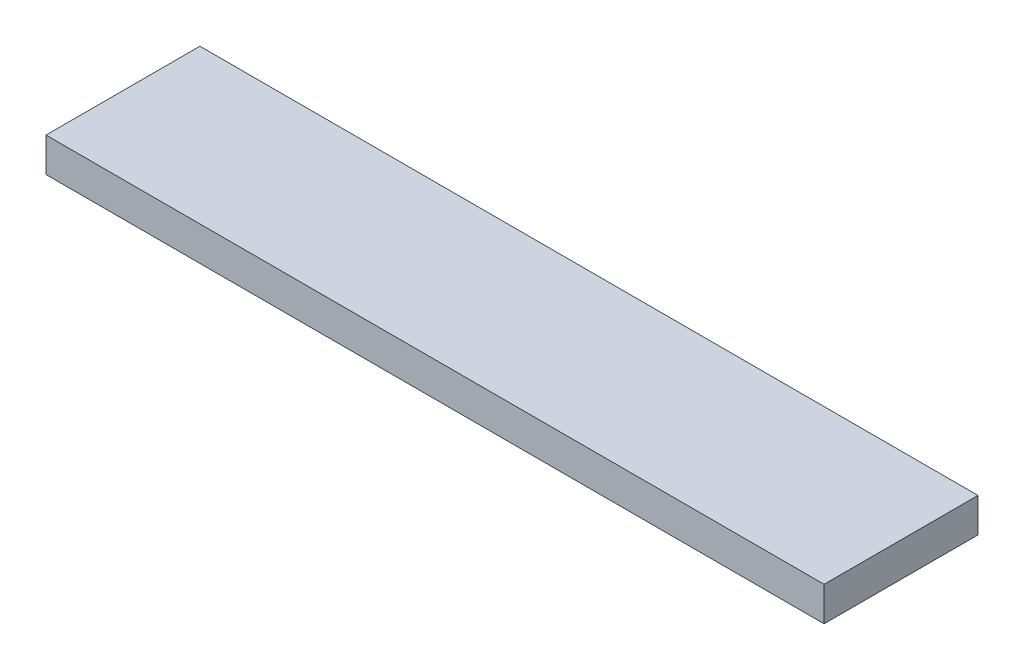
ISO-10303-21;
HEADER;
FILE_DESCRIPTION(('STEP AP214'),'2;1');
FILE_NAME('part.step','',(''),(''),'','','');
FILE_SCHEMA(('AUTOMOTIVE_DESIGN { 1 0 10303 214 1 1 1 1 }'));
ENDSEC;
DATA;
#1=APPLICATION_CONTEXT('core data for automotive mechanical design processes');
#2=APPLICATION_PROTOCOL_DEFINITION('international standard','automotive_design',2000,#1);
#3=PRODUCT_CONTEXT('',#1,'mechanical');
#4=PRODUCT('Part','Part','',(#3));
#5=PRODUCT_RELATED_PRODUCT_CATEGORY('part','',(#4));
#6=PRODUCT_DEFINITION_FORMATION('','',#4);
#7=PRODUCT_DEFINITION_CONTEXT('part definition',#1,'design');
#8=PRODUCT_DEFINITION('design','',#6,#7);
#9=PRODUCT_DEFINITION_SHAPE('','',#8);
#10=(LENGTH_UNIT() NAMED_UNIT(*) SI_UNIT(.MILLI.,.METRE.));
#11=(NAMED_UNIT(*) PLANE_ANGLE_UNIT() SI_UNIT($,.RADIAN.));
#12=(NAMED_UNIT(*) SI_UNIT($,.STERADIAN.) SOLID_ANGLE_UNIT());
#13=UNCERTAINTY_MEASURE_WITH_UNIT(LENGTH_MEASURE(1.E-05),#10,'distance_accuracy_value','');
#14=(GEOMETRIC_REPRESENTATION_CONTEXT(3) GLOBAL_UNCERTAINTY_ASSIGNED_CONTEXT((#13)) GLOBAL_UNIT_ASSIGNED_CONTEXT((#10,
#11,#12)) REPRESENTATION_CONTEXT('',''));
#15=CARTESIAN_POINT('',(0.,0.,0.));
#16=DIRECTION('',(0.,0.,1.));
#17=DIRECTION('',(1.,0.,0.));
#18=AXIS2_PLACEMENT_3D('',#15,#16,#17);
#19=CARTESIAN_POINT('',(0.,8.,0.));
#20=DIRECTION('',(1.,0.,0.));
#21=DIRECTION('',(0.,0.,-1.));
#22=AXIS2_PLACEMENT_3D('',#19,#20,#21);
#23=PLANE('',#22);
#24=DIRECTION('',(0.,0.,1.));
#25=VECTOR('',#24,1.);
#26=CARTESIAN_POINT('',(0.,0.,0.));
#27=LINE('',#26,#25);
#28=CARTESIAN_POINT('',(0.,0.,-36.));
#29=VERTEX_POINT('',#28);
#30=CARTESIAN_POINT('',(0.,0.,0.));
#31=VERTEX_POINT('',#30);
#32=EDGE_CURVE('E95',#29,#31,#27,.T.);
#33=ORIENTED_EDGE('',*,*,#32,.T.);
#34=DIRECTION('',(0.,-1.,0.));
#35=VECTOR('',#34,1.);
#36=CARTESIAN_POINT('',(0.,8.,0.));
#37=LINE('',#36,#35);
#38=CARTESIAN_POINT('',(0.,8.,0.));
#39=VERTEX_POINT('',#38);
#40=EDGE_CURVE('E11',#39,#31,#37,.T.);
#41=ORIENTED_EDGE('',*,*,#40,.F.);
#42=DIRECTION('',(0.,0.,1.));
#43=VECTOR('',#42,1.);
#44=CARTESIAN_POINT('',(0.,8.,0.));
#45=LINE('',#44,#43);
#46=CARTESIAN_POINT('',(0.,8.,-36.));
#47=VERTEX_POINT('',#46);
#48=EDGE_CURVE('E83',#47,#39,#45,.T.);
#49=ORIENTED_EDGE('',*,*,#48,.F.);
#50=DIRECTION('',(0.,-1.,0.));
#51=VECTOR('',#50,1.);
#52=CARTESIAN_POINT('',(0.,8.,-36.));
#53=LINE('',#52,#51);
#54=EDGE_CURVE('E91',#47,#29,#53,.T.);
#55=ORIENTED_EDGE('',*,*,#54,.T.);
#56=EDGE_LOOP('',(#33,#41,#49,#55));
#57=FACE_BOUND('',#56,.T.);
#58=ADVANCED_FACE('F32',(#57),#23,.F.);
#59=CARTESIAN_POINT('',(0.,8.,0.));
#60=DIRECTION('',(0.,0.,-1.));
#61=DIRECTION('',(-1.,0.,0.));
#62=AXIS2_PLACEMENT_3D('',#59,#60,#61);
#63=PLANE('',#62);
#64=DIRECTION('',(1.,0.,0.));
#65=VECTOR('',#64,1.);
#66=CARTESIAN_POINT('',(0.,0.,0.));
#67=LINE('',#66,#65);
#68=CARTESIAN_POINT('',(182.,0.,0.));
#69=VERTEX_POINT('',#68);
#70=EDGE_CURVE('E87',#31,#69,#67,.T.);
#71=ORIENTED_EDGE('',*,*,#70,.T.);
#72=DIRECTION('',(0.,-1.,0.));
#73=VECTOR('',#72,1.);
#74=CARTESIAN_POINT('',(182.,8.,0.));
#75=LINE('',#74,#73);
#76=CARTESIAN_POINT('',(182.,8.,0.));
#77=VERTEX_POINT('',#76);
#78=EDGE_CURVE('E40',#77,#69,#75,.T.);
#79=ORIENTED_EDGE('',*,*,#78,.F.);
#80=DIRECTION('',(1.,0.,0.));
#81=VECTOR('',#80,1.);
#82=CARTESIAN_POINT('',(0.,8.,0.));
#83=LINE('',#82,#81);
#84=EDGE_CURVE('E78',#39,#77,#83,.T.);
#85=ORIENTED_EDGE('',*,*,#84,.F.);
#86=ORIENTED_EDGE('',*,*,#40,.T.);
#87=EDGE_LOOP('',(#71,#79,#85,#86));
#88=FACE_BOUND('',#87,.T.);
#89=ADVANCED_FACE('F86',(#88),#63,.F.);
#90=CARTESIAN_POINT('',(182.,8.,0.));
#91=DIRECTION('',(-1.,0.,0.));
#92=DIRECTION('',(0.,0.,1.));
#93=AXIS2_PLACEMENT_3D('',#90,#91,#92);
#94=PLANE('',#93);
#95=DIRECTION('',(0.,0.,-1.));
#96=VECTOR('',#95,1.);
#97=CARTESIAN_POINT('',(182.,0.,0.));
#98=LINE('',#97,#96);
#99=CARTESIAN_POINT('',(182.,0.,-36.));
#100=VERTEX_POINT('',#99);
#101=EDGE_CURVE('E65',#69,#100,#98,.T.);
#102=ORIENTED_EDGE('',*,*,#101,.T.);
#103=DIRECTION('',(0.,-1.,0.));
#104=VECTOR('',#103,1.);
#105=CARTESIAN_POINT('',(182.,8.,-36.));
#106=LINE('',#105,#104);
#107=CARTESIAN_POINT('',(182.,8.,-36.));
#108=VERTEX_POINT('',#107);
#109=EDGE_CURVE('E88',#108,#100,#106,.T.);
#110=ORIENTED_EDGE('',*,*,#109,.F.);
#111=DIRECTION('',(0.,0.,-1.));
#112=VECTOR('',#111,1.);
#113=CARTESIAN_POINT('',(182.,8.,0.));
#114=LINE('',#113,#112);
#115=EDGE_CURVE('E81',#77,#108,#114,.T.);
#116=ORIENTED_EDGE('',*,*,#115,.F.);
#117=ORIENTED_EDGE('',*,*,#78,.T.);
#118=EDGE_LOOP('',(#102,#110,#116,#117));
#119=FACE_BOUND('',#118,.T.);
#120=ADVANCED_FACE('F89',(#119),#94,.F.);
#121=CARTESIAN_POINT('',(0.,8.,-36.));
#122=DIRECTION('',(0.,0.,1.));
#123=DIRECTION('',(1.,0.,0.));
#124=AXIS2_PLACEMENT_3D('',#121,#122,#123);
#125=PLANE('',#124);
#126=DIRECTION('',(-1.,0.,0.));
#127=VECTOR('',#126,1.);
#128=CARTESIAN_POINT('',(0.,0.,-36.));
#129=LINE('',#128,#127);
#130=EDGE_CURVE('E71',#100,#29,#129,.T.);
#131=ORIENTED_EDGE('',*,*,#130,.T.);
#132=ORIENTED_EDGE('',*,*,#54,.F.);
#133=DIRECTION('',(-1.,0.,0.));
#134=VECTOR('',#133,1.);
#135=CARTESIAN_POINT('',(0.,8.,-36.));
#136=LINE('',#135,#134);
#137=EDGE_CURVE('E48',#108,#47,#136,.T.);
#138=ORIENTED_EDGE('',*,*,#137,.F.);
#139=ORIENTED_EDGE('',*,*,#109,.T.);
#140=EDGE_LOOP('',(#131,#132,#138,#139));
#141=FACE_BOUND('',#140,.T.);
#142=ADVANCED_FACE('F102',(#141),#125,.F.);
#143=CARTESIAN_POINT('',(0.,8.,-36.));
#144=DIRECTION('',(0.,-1.,0.));
#145=DIRECTION('',(0.,0.,-1.));
#146=AXIS2_PLACEMENT_3D('',#143,#144,#145);
#147=PLANE('',#146);
#148=ORIENTED_EDGE('',*,*,#48,.T.);
#149=ORIENTED_EDGE('',*,*,#84,.T.);
#150=ORIENTED_EDGE('',*,*,#115,.T.);
#151=ORIENTED_EDGE('',*,*,#137,.T.);
#152=EDGE_LOOP('',(#148,#149,#150,#151));
#153=FACE_BOUND('',#152,.T.);
#154=ADVANCED_FACE('F79',(#153),#147,.F.);
#155=CARTESIAN_POINT('',(0.,0.,-36.));
#156=DIRECTION('',(0.,-1.,0.));
#157=DIRECTION('',(0.,0.,-1.));
#158=AXIS2_PLACEMENT_3D('',#155,#156,#157);
#159=PLANE('',#158);
#160=ORIENTED_EDGE('',*,*,#32,.F.);
#161=ORIENTED_EDGE('',*,*,#130,.F.);
#162=ORIENTED_EDGE('',*,*,#101,.F.);
#163=ORIENTED_EDGE('',*,*,#70,.F.);
#164=EDGE_LOOP('',(#160,#161,#162,#163));
#165=FACE_BOUND('',#164,.T.);
#166=ADVANCED_FACE('F105',(#165),#159,.T.);
#167=CLOSED_SHELL('',(#58,#89,#120,#142,#154,#166));
#168=MANIFOLD_SOLID_BREP('B2',#167);
#169=ADVANCED_BREP_SHAPE_REPRESENTATION('',(#18,#168),#14);
#170=SHAPE_DEFINITION_REPRESENTATION(#9,#169);
ENDSEC;
END-ISO-10303-21;
